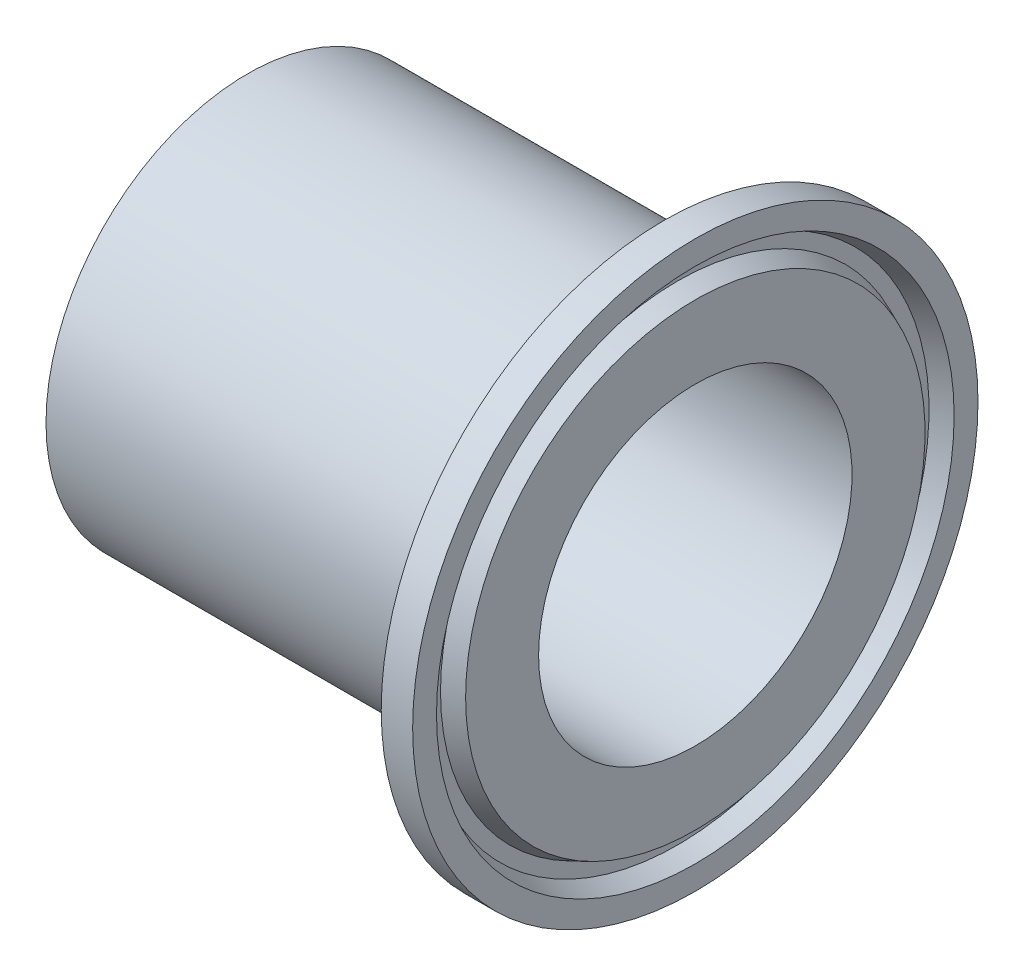
ISO-10303-21;
HEADER;
FILE_DESCRIPTION(('STEP AP214'),'2;1');
FILE_NAME('part.step','',(''),(''),'','','');
FILE_SCHEMA(('AUTOMOTIVE_DESIGN { 1 0 10303 214 1 1 1 1 }'));
ENDSEC;
DATA;
#1=APPLICATION_CONTEXT('core data for automotive mechanical design processes');
#2=APPLICATION_PROTOCOL_DEFINITION('international standard','automotive_design',2000,#1);
#3=PRODUCT_CONTEXT('',#1,'mechanical');
#4=PRODUCT('Part','Part','',(#3));
#5=PRODUCT_RELATED_PRODUCT_CATEGORY('part','',(#4));
#6=PRODUCT_DEFINITION_FORMATION('','',#4);
#7=PRODUCT_DEFINITION_CONTEXT('part definition',#1,'design');
#8=PRODUCT_DEFINITION('design','',#6,#7);
#9=PRODUCT_DEFINITION_SHAPE('','',#8);
#10=(LENGTH_UNIT() NAMED_UNIT(*) SI_UNIT(.MILLI.,.METRE.));
#11=(NAMED_UNIT(*) PLANE_ANGLE_UNIT() SI_UNIT($,.RADIAN.));
#12=(NAMED_UNIT(*) SI_UNIT($,.STERADIAN.) SOLID_ANGLE_UNIT());
#13=UNCERTAINTY_MEASURE_WITH_UNIT(LENGTH_MEASURE(1.E-05),#10,'distance_accuracy_value','');
#14=(GEOMETRIC_REPRESENTATION_CONTEXT(3) GLOBAL_UNCERTAINTY_ASSIGNED_CONTEXT((#13)) GLOBAL_UNIT_ASSIGNED_CONTEXT((#10,
#11,#12)) REPRESENTATION_CONTEXT('',''));
#15=CARTESIAN_POINT('',(0.,0.,0.));
#16=DIRECTION('',(0.,0.,1.));
#17=DIRECTION('',(1.,0.,0.));
#18=AXIS2_PLACEMENT_3D('',#15,#16,#17);
#19=CARTESIAN_POINT('',(40.,20.5186,0.));
#20=DIRECTION('',(-1.,0.,0.));
#21=DIRECTION('',(0.,0.,1.));
#22=AXIS2_PLACEMENT_3D('',#19,#20,#21);
#23=PLANE('',#22);
#24=CARTESIAN_POINT('',(40.,0.,0.));
#25=DIRECTION('',(-1.,0.,0.));
#26=DIRECTION('',(0.,0.,1.));
#27=AXIS2_PLACEMENT_3D('',#24,#25,#26);
#28=CIRCLE('',#27,14.);
#29=CARTESIAN_POINT('',(40.,0.,14.));
#30=VERTEX_POINT('',#29);
#31=EDGE_CURVE('E74',#30,#30,#28,.T.);
#32=ORIENTED_EDGE('',*,*,#31,.T.);
#33=EDGE_LOOP('',(#32));
#34=FACE_BOUND('',#33,.T.);
#35=CARTESIAN_POINT('',(40.,0.,0.));
#36=DIRECTION('',(-1.,0.,0.));
#37=DIRECTION('',(0.,0.,1.));
#38=AXIS2_PLACEMENT_3D('',#35,#36,#37);
#39=CIRCLE('',#38,20.5186);
#40=CARTESIAN_POINT('',(40.,0.,20.5186));
#41=VERTEX_POINT('',#40);
#42=EDGE_CURVE('E47',#41,#41,#39,.T.);
#43=ORIENTED_EDGE('',*,*,#42,.F.);
#44=EDGE_LOOP('',(#43));
#45=FACE_BOUND('',#44,.T.);
#46=ADVANCED_FACE('F35',(#34,#45),#23,.F.);
#47=CARTESIAN_POINT('',(40.,0.,0.));
#48=DIRECTION('',(-1.,0.,0.));
#49=DIRECTION('',(0.,0.,1.));
#50=AXIS2_PLACEMENT_3D('',#47,#48,#49);
#51=CONICAL_SURFACE('',#50,20.5186,0.401425727958692);
#52=CARTESIAN_POINT('',(38.4252,0.,0.));
#53=DIRECTION('',(-1.,0.,0.));
#54=DIRECTION('',(0.,0.,1.));
#55=AXIS2_PLACEMENT_3D('',#52,#53,#54);
#56=CIRCLE('',#55,21.1870629405669);
#57=CARTESIAN_POINT('',(38.4252,0.,21.1870629405669));
#58=VERTEX_POINT('',#57);
#59=EDGE_CURVE('E51',#58,#58,#56,.T.);
#60=ORIENTED_EDGE('',*,*,#59,.F.);
#61=EDGE_LOOP('',(#60));
#62=FACE_BOUND('',#61,.T.);
#63=ORIENTED_EDGE('',*,*,#42,.T.);
#64=EDGE_LOOP('',(#63));
#65=FACE_BOUND('',#64,.T.);
#66=ADVANCED_FACE('F92',(#62,#65),#51,.T.);
#67=CARTESIAN_POINT('',(38.4252,22.4501370594331,0.));
#68=DIRECTION('',(-1.,0.,0.));
#69=DIRECTION('',(0.,0.,1.));
#70=AXIS2_PLACEMENT_3D('',#67,#68,#69);
#71=PLANE('',#70);
#72=CARTESIAN_POINT('',(38.4252,0.,0.));
#73=DIRECTION('',(-1.,0.,0.));
#74=DIRECTION('',(0.,0.,1.));
#75=AXIS2_PLACEMENT_3D('',#72,#73,#74);
#76=CIRCLE('',#75,22.4501370594331);
#77=CARTESIAN_POINT('',(38.4252,0.,22.4501370594331));
#78=VERTEX_POINT('',#77);
#79=EDGE_CURVE('E56',#78,#78,#76,.T.);
#80=ORIENTED_EDGE('',*,*,#79,.F.);
#81=EDGE_LOOP('',(#80));
#82=FACE_BOUND('',#81,.T.);
#83=ORIENTED_EDGE('',*,*,#59,.T.);
#84=EDGE_LOOP('',(#83));
#85=FACE_BOUND('',#84,.T.);
#86=ADVANCED_FACE('F96',(#82,#85),#71,.F.);
#87=CARTESIAN_POINT('',(38.4252,0.,0.));
#88=DIRECTION('',(1.,0.,0.));
#89=DIRECTION('',(0.,0.,-1.));
#90=AXIS2_PLACEMENT_3D('',#87,#88,#89);
#91=CONICAL_SURFACE('',#90,22.4501370594331,0.401425727958692);
#92=CARTESIAN_POINT('',(40.,0.,0.));
#93=DIRECTION('',(-1.,0.,0.));
#94=DIRECTION('',(0.,0.,1.));
#95=AXIS2_PLACEMENT_3D('',#92,#93,#94);
#96=CIRCLE('',#95,23.1186);
#97=CARTESIAN_POINT('',(40.,0.,23.1186));
#98=VERTEX_POINT('',#97);
#99=EDGE_CURVE('E59',#98,#98,#96,.T.);
#100=ORIENTED_EDGE('',*,*,#99,.F.);
#101=EDGE_LOOP('',(#100));
#102=FACE_BOUND('',#101,.T.);
#103=ORIENTED_EDGE('',*,*,#79,.T.);
#104=EDGE_LOOP('',(#103));
#105=FACE_BOUND('',#104,.T.);
#106=ADVANCED_FACE('F102',(#102,#105),#91,.F.);
#107=CARTESIAN_POINT('',(40.,25.25,0.));
#108=DIRECTION('',(-1.,0.,0.));
#109=DIRECTION('',(0.,0.,1.));
#110=AXIS2_PLACEMENT_3D('',#107,#108,#109);
#111=PLANE('',#110);
#112=CARTESIAN_POINT('',(40.,0.,0.));
#113=DIRECTION('',(-1.,0.,0.));
#114=DIRECTION('',(0.,0.,1.));
#115=AXIS2_PLACEMENT_3D('',#112,#113,#114);
#116=CIRCLE('',#115,25.25);
#117=CARTESIAN_POINT('',(40.,0.,25.25));
#118=VERTEX_POINT('',#117);
#119=EDGE_CURVE('E62',#118,#118,#116,.T.);
#120=ORIENTED_EDGE('',*,*,#119,.F.);
#121=EDGE_LOOP('',(#120));
#122=FACE_BOUND('',#121,.T.);
#123=ORIENTED_EDGE('',*,*,#99,.T.);
#124=EDGE_LOOP('',(#123));
#125=FACE_BOUND('',#124,.T.);
#126=ADVANCED_FACE('F106',(#122,#125),#111,.F.);
#127=CARTESIAN_POINT('',(0.,0.,0.));
#128=DIRECTION('',(-1.,0.,0.));
#129=DIRECTION('',(0.,0.,1.));
#130=AXIS2_PLACEMENT_3D('',#127,#128,#129);
#131=CYLINDRICAL_SURFACE('',#130,25.25);
#132=CARTESIAN_POINT('',(37.1933,0.,0.));
#133=DIRECTION('',(-1.,0.,0.));
#134=DIRECTION('',(0.,0.,1.));
#135=AXIS2_PLACEMENT_3D('',#132,#133,#134);
#136=CIRCLE('',#135,25.25);
#137=CARTESIAN_POINT('',(37.1933,0.,25.25));
#138=VERTEX_POINT('',#137);
#139=EDGE_CURVE('E65',#138,#138,#136,.T.);
#140=ORIENTED_EDGE('',*,*,#139,.F.);
#141=EDGE_LOOP('',(#140));
#142=FACE_BOUND('',#141,.T.);
#143=ORIENTED_EDGE('',*,*,#119,.T.);
#144=EDGE_LOOP('',(#143));
#145=FACE_BOUND('',#144,.T.);
#146=ADVANCED_FACE('F110',(#142,#145),#131,.T.);
#147=CARTESIAN_POINT('',(37.1933,0.,0.));
#148=DIRECTION('',(1.,0.,0.));
#149=DIRECTION('',(0.,0.,-1.));
#150=AXIS2_PLACEMENT_3D('',#147,#148,#149);
#151=CONICAL_SURFACE('',#150,25.25,1.22173047639604);
#152=CARTESIAN_POINT('',(34.5545158015701,0.,0.));
#153=DIRECTION('',(-1.,0.,0.));
#154=DIRECTION('',(0.,0.,1.));
#155=AXIS2_PLACEMENT_3D('',#152,#153,#154);
#156=CIRCLE('',#155,18.);
#157=CARTESIAN_POINT('',(34.5545158015701,0.,18.));
#158=VERTEX_POINT('',#157);
#159=EDGE_CURVE('E68',#158,#158,#156,.T.);
#160=ORIENTED_EDGE('',*,*,#159,.F.);
#161=EDGE_LOOP('',(#160));
#162=FACE_BOUND('',#161,.T.);
#163=ORIENTED_EDGE('',*,*,#139,.T.);
#164=EDGE_LOOP('',(#163));
#165=FACE_BOUND('',#164,.T.);
#166=ADVANCED_FACE('F114',(#162,#165),#151,.T.);
#167=CARTESIAN_POINT('',(0.,0.,0.));
#168=DIRECTION('',(-1.,0.,0.));
#169=DIRECTION('',(0.,0.,1.));
#170=AXIS2_PLACEMENT_3D('',#167,#168,#169);
#171=CYLINDRICAL_SURFACE('',#170,18.);
#172=CARTESIAN_POINT('',(0.,0.,0.));
#173=DIRECTION('',(-1.,0.,0.));
#174=DIRECTION('',(0.,0.,1.));
#175=AXIS2_PLACEMENT_3D('',#172,#173,#174);
#176=CIRCLE('',#175,18.);
#177=CARTESIAN_POINT('',(0.,0.,18.));
#178=VERTEX_POINT('',#177);
#179=EDGE_CURVE('E71',#178,#178,#176,.T.);
#180=ORIENTED_EDGE('',*,*,#179,.F.);
#181=EDGE_LOOP('',(#180));
#182=FACE_BOUND('',#181,.T.);
#183=ORIENTED_EDGE('',*,*,#159,.T.);
#184=EDGE_LOOP('',(#183));
#185=FACE_BOUND('',#184,.T.);
#186=ADVANCED_FACE('F89',(#182,#185),#171,.T.);
#187=CARTESIAN_POINT('',(0.,14.,0.));
#188=DIRECTION('',(1.,0.,0.));
#189=DIRECTION('',(0.,0.,-1.));
#190=AXIS2_PLACEMENT_3D('',#187,#188,#189);
#191=PLANE('',#190);
#192=CARTESIAN_POINT('',(0.,0.,0.));
#193=DIRECTION('',(1.,0.,0.));
#194=DIRECTION('',(0.,0.,-1.));
#195=AXIS2_PLACEMENT_3D('',#192,#193,#194);
#196=CIRCLE('',#195,16.);
#197=CARTESIAN_POINT('',(0.,0.,-16.));
#198=VERTEX_POINT('',#197);
#199=EDGE_CURVE('E10',#198,#198,#196,.T.);
#200=ORIENTED_EDGE('',*,*,#199,.T.);
#201=EDGE_LOOP('',(#200));
#202=FACE_BOUND('',#201,.T.);
#203=ORIENTED_EDGE('',*,*,#179,.T.);
#204=EDGE_LOOP('',(#203));
#205=FACE_BOUND('',#204,.T.);
#206=ADVANCED_FACE('F82',(#202,#205),#191,.F.);
#207=CARTESIAN_POINT('',(0.,0.,0.));
#208=DIRECTION('',(-1.,0.,0.));
#209=DIRECTION('',(0.,0.,1.));
#210=AXIS2_PLACEMENT_3D('',#207,#208,#209);
#211=CYLINDRICAL_SURFACE('',#210,14.);
#212=CARTESIAN_POINT('',(2.00000000000002,0.,0.));
#213=DIRECTION('',(1.,0.,0.));
#214=DIRECTION('',(0.,0.,-1.));
#215=AXIS2_PLACEMENT_3D('',#212,#213,#214);
#216=CIRCLE('',#215,14.);
#217=CARTESIAN_POINT('',(2.00000000000002,0.,-14.));
#218=VERTEX_POINT('',#217);
#219=EDGE_CURVE('E43',#218,#218,#216,.F.);
#220=ORIENTED_EDGE('',*,*,#219,.T.);
#221=EDGE_LOOP('',(#220));
#222=FACE_BOUND('',#221,.T.);
#223=ORIENTED_EDGE('',*,*,#31,.F.);
#224=EDGE_LOOP('',(#223));
#225=FACE_BOUND('',#224,.T.);
#226=ADVANCED_FACE('F80',(#222,#225),#211,.F.);
#227=CARTESIAN_POINT('',(2.00000000000002,0.,0.));
#228=DIRECTION('',(-1.,0.,0.));
#229=DIRECTION('',(0.,0.,1.));
#230=AXIS2_PLACEMENT_3D('',#227,#228,#229);
#231=CONICAL_SURFACE('',#230,14.,0.785398163397448);
#232=ORIENTED_EDGE('',*,*,#199,.F.);
#233=EDGE_LOOP('',(#232));
#234=FACE_BOUND('',#233,.T.);
#235=ORIENTED_EDGE('',*,*,#219,.F.);
#236=EDGE_LOOP('',(#235));
#237=FACE_BOUND('',#236,.T.);
#238=ADVANCED_FACE('F38',(#234,#237),#231,.F.);
#239=CLOSED_SHELL('',(#46,#66,#86,#106,#126,#146,#166,#186,#206,#226,#238));
#240=MANIFOLD_SOLID_BREP('B2',#239);
#241=ADVANCED_BREP_SHAPE_REPRESENTATION('',(#18,#240),#14);
#242=SHAPE_DEFINITION_REPRESENTATION(#9,#241);
ENDSEC;
END-ISO-10303-21;
